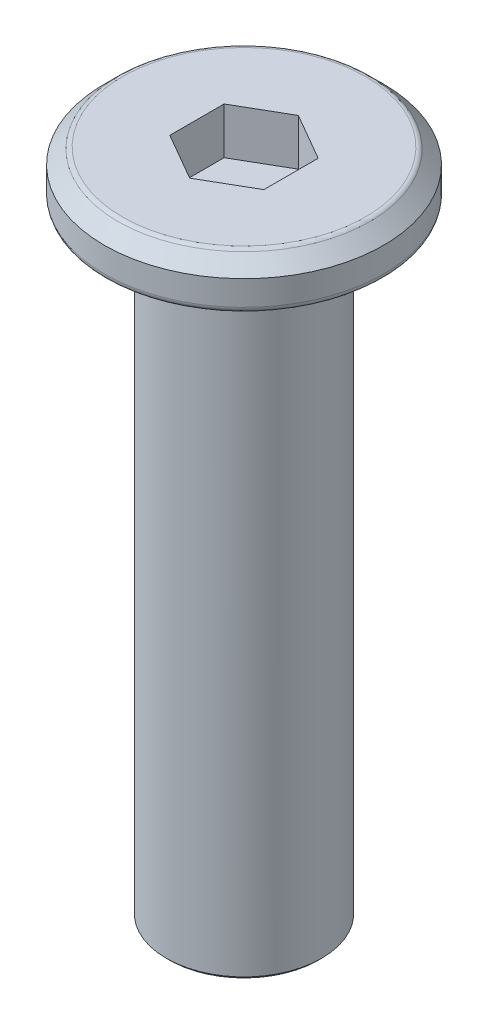
ISO-10303-21;
HEADER;
FILE_DESCRIPTION(('STEP AP214'),'2;1');
FILE_NAME('part.step','',(''),(''),'','','');
FILE_SCHEMA(('AUTOMOTIVE_DESIGN { 1 0 10303 214 1 1 1 1 }'));
ENDSEC;
DATA;
#1=APPLICATION_CONTEXT('core data for automotive mechanical design processes');
#2=APPLICATION_PROTOCOL_DEFINITION('international standard','automotive_design',2000,#1);
#3=PRODUCT_CONTEXT('',#1,'mechanical');
#4=PRODUCT('Part','Part','',(#3));
#5=PRODUCT_RELATED_PRODUCT_CATEGORY('part','',(#4));
#6=PRODUCT_DEFINITION_FORMATION('','',#4);
#7=PRODUCT_DEFINITION_CONTEXT('part definition',#1,'design');
#8=PRODUCT_DEFINITION('design','',#6,#7);
#9=PRODUCT_DEFINITION_SHAPE('','',#8);
#10=(LENGTH_UNIT() NAMED_UNIT(*) SI_UNIT(.MILLI.,.METRE.));
#11=(NAMED_UNIT(*) PLANE_ANGLE_UNIT() SI_UNIT($,.RADIAN.));
#12=(NAMED_UNIT(*) SI_UNIT($,.STERADIAN.) SOLID_ANGLE_UNIT());
#13=UNCERTAINTY_MEASURE_WITH_UNIT(LENGTH_MEASURE(1.E-05),#10,'distance_accuracy_value','');
#14=(GEOMETRIC_REPRESENTATION_CONTEXT(3) GLOBAL_UNCERTAINTY_ASSIGNED_CONTEXT((#13)) GLOBAL_UNIT_ASSIGNED_CONTEXT((#10,
#11,#12)) REPRESENTATION_CONTEXT('',''));
#15=CARTESIAN_POINT('',(0.,0.,0.));
#16=DIRECTION('',(0.,0.,1.));
#17=DIRECTION('',(1.,0.,0.));
#18=AXIS2_PLACEMENT_3D('',#15,#16,#17);
#19=CARTESIAN_POINT('',(0.,1.5,0.));
#20=DIRECTION('',(0.,-1.,0.));
#21=DIRECTION('',(0.,0.,-1.));
#22=AXIS2_PLACEMENT_3D('',#19,#20,#21);
#23=CYLINDRICAL_SURFACE('',#22,4.5);
#24=CARTESIAN_POINT('',(0.,0.2,0.));
#25=DIRECTION('',(0.,1.,0.));
#26=DIRECTION('',(0.,0.,1.));
#27=AXIS2_PLACEMENT_3D('',#24,#25,#26);
#28=CIRCLE('',#27,4.5);
#29=CARTESIAN_POINT('',(0.,0.2,4.5));
#30=VERTEX_POINT('',#29);
#31=EDGE_CURVE('E131',#30,#30,#28,.T.);
#32=ORIENTED_EDGE('',*,*,#31,.T.);
#33=EDGE_LOOP('',(#32));
#34=FACE_BOUND('',#33,.T.);
#35=CARTESIAN_POINT('',(0.,0.999999999999997,0.));
#36=DIRECTION('',(0.,1.,0.));
#37=DIRECTION('',(0.,0.,1.));
#38=AXIS2_PLACEMENT_3D('',#35,#36,#37);
#39=CIRCLE('',#38,4.5);
#40=CARTESIAN_POINT('',(0.,0.999999999999997,4.5));
#41=VERTEX_POINT('',#40);
#42=EDGE_CURVE('E117',#41,#41,#39,.F.);
#43=ORIENTED_EDGE('',*,*,#42,.T.);
#44=EDGE_LOOP('',(#43));
#45=FACE_BOUND('',#44,.T.);
#46=ADVANCED_FACE('F16',(#34,#45),#23,.T.);
#47=CARTESIAN_POINT('',(0.,1.5,0.));
#48=DIRECTION('',(0.,1.,0.));
#49=DIRECTION('',(0.,0.,1.));
#50=AXIS2_PLACEMENT_3D('',#47,#48,#49);
#51=PLANE('',#50);
#52=CARTESIAN_POINT('',(0.,1.5,0.));
#53=DIRECTION('',(0.,1.,0.));
#54=DIRECTION('',(0.,0.,1.));
#55=AXIS2_PLACEMENT_3D('',#52,#53,#54);
#56=CIRCLE('',#55,3.91715728752538);
#57=CARTESIAN_POINT('',(0.,1.5,3.91715728752538));
#58=VERTEX_POINT('',#57);
#59=EDGE_CURVE('E125',#58,#58,#56,.T.);
#60=ORIENTED_EDGE('',*,*,#59,.T.);
#61=EDGE_LOOP('',(#60));
#62=FACE_BOUND('',#61,.T.);
#63=DIRECTION('',(-0.866025403784438,0.,-0.5));
#64=VECTOR('',#63,1.);
#65=CARTESIAN_POINT('',(1.51554445662277,1.5,-0.875));
#66=LINE('',#65,#64);
#67=CARTESIAN_POINT('',(1.51554445662277,1.5,-0.875));
#68=VERTEX_POINT('',#67);
#69=CARTESIAN_POINT('',(0.,1.5,-1.75));
#70=VERTEX_POINT('',#69);
#71=EDGE_CURVE('E32',#68,#70,#66,.T.);
#72=ORIENTED_EDGE('',*,*,#71,.F.);
#73=DIRECTION('',(0.,0.,-1.));
#74=VECTOR('',#73,1.);
#75=CARTESIAN_POINT('',(1.51554445662277,1.5,0.875000000000001));
#76=LINE('',#75,#74);
#77=CARTESIAN_POINT('',(1.51554445662277,1.5,0.875000000000001));
#78=VERTEX_POINT('',#77);
#79=EDGE_CURVE('E113',#78,#68,#76,.T.);
#80=ORIENTED_EDGE('',*,*,#79,.F.);
#81=DIRECTION('',(0.866025403784439,0.,-0.5));
#82=VECTOR('',#81,1.);
#83=CARTESIAN_POINT('',(0.,1.5,1.75));
#84=LINE('',#83,#82);
#85=CARTESIAN_POINT('',(0.,1.5,1.75));
#86=VERTEX_POINT('',#85);
#87=EDGE_CURVE('E111',#86,#78,#84,.T.);
#88=ORIENTED_EDGE('',*,*,#87,.F.);
#89=DIRECTION('',(0.866025403784438,0.,0.5));
#90=VECTOR('',#89,1.);
#91=CARTESIAN_POINT('',(-1.51554445662277,1.5,0.874999999999999));
#92=LINE('',#91,#90);
#93=CARTESIAN_POINT('',(-1.51554445662277,1.5,0.874999999999999));
#94=VERTEX_POINT('',#93);
#95=EDGE_CURVE('E79',#94,#86,#92,.T.);
#96=ORIENTED_EDGE('',*,*,#95,.F.);
#97=DIRECTION('',(0.,0.,1.));
#98=VECTOR('',#97,1.);
#99=CARTESIAN_POINT('',(-1.51554445662277,1.5,-0.875));
#100=LINE('',#99,#98);
#101=CARTESIAN_POINT('',(-1.51554445662277,1.5,-0.875));
#102=VERTEX_POINT('',#101);
#103=EDGE_CURVE('E107',#102,#94,#100,.T.);
#104=ORIENTED_EDGE('',*,*,#103,.F.);
#105=DIRECTION('',(-0.866025403784439,0.,0.5));
#106=VECTOR('',#105,1.);
#107=CARTESIAN_POINT('',(0.,1.5,-1.75));
#108=LINE('',#107,#106);
#109=EDGE_CURVE('E104',#70,#102,#108,.T.);
#110=ORIENTED_EDGE('',*,*,#109,.F.);
#111=EDGE_LOOP('',(#72,#80,#88,#96,#104,#110));
#112=FACE_BOUND('',#111,.T.);
#113=ADVANCED_FACE('F158',(#62,#112),#51,.T.);
#114=CARTESIAN_POINT('',(0.,0.,0.));
#115=DIRECTION('',(0.,1.,0.));
#116=DIRECTION('',(0.,0.,1.));
#117=AXIS2_PLACEMENT_3D('',#114,#115,#116);
#118=PLANE('',#117);
#119=CARTESIAN_POINT('',(0.,0.,0.));
#120=DIRECTION('',(0.,1.,0.));
#121=DIRECTION('',(0.,0.,1.));
#122=AXIS2_PLACEMENT_3D('',#119,#120,#121);
#123=CIRCLE('',#122,2.75);
#124=CARTESIAN_POINT('',(0.,0.,2.75));
#125=VERTEX_POINT('',#124);
#126=EDGE_CURVE('E140',#125,#125,#123,.T.);
#127=ORIENTED_EDGE('',*,*,#126,.T.);
#128=EDGE_LOOP('',(#127));
#129=FACE_BOUND('',#128,.T.);
#130=CARTESIAN_POINT('',(0.,0.,0.));
#131=DIRECTION('',(0.,1.,0.));
#132=DIRECTION('',(0.,0.,1.));
#133=AXIS2_PLACEMENT_3D('',#130,#131,#132);
#134=CIRCLE('',#133,4.3);
#135=CARTESIAN_POINT('',(0.,0.,4.3));
#136=VERTEX_POINT('',#135);
#137=EDGE_CURVE('E134',#136,#136,#134,.F.);
#138=ORIENTED_EDGE('',*,*,#137,.T.);
#139=EDGE_LOOP('',(#138));
#140=FACE_BOUND('',#139,.T.);
#141=ADVANCED_FACE('F164',(#129,#140),#118,.F.);
#142=CARTESIAN_POINT('',(0.,1.5,0.));
#143=DIRECTION('',(0.,-1.,0.));
#144=DIRECTION('',(0.,0.,-1.));
#145=AXIS2_PLACEMENT_3D('',#142,#143,#144);
#146=CONICAL_SURFACE('',#145,4.,0.785398163397447);
#147=CARTESIAN_POINT('',(0.,1.44142135623731,0.));
#148=DIRECTION('',(0.,1.,0.));
#149=DIRECTION('',(0.,0.,1.));
#150=AXIS2_PLACEMENT_3D('',#147,#148,#149);
#151=CIRCLE('',#150,4.05857864376269);
#152=CARTESIAN_POINT('',(0.,1.44142135623731,4.05857864376269));
#153=VERTEX_POINT('',#152);
#154=EDGE_CURVE('E128',#153,#153,#151,.F.);
#155=ORIENTED_EDGE('',*,*,#154,.T.);
#156=EDGE_LOOP('',(#155));
#157=FACE_BOUND('',#156,.T.);
#158=ORIENTED_EDGE('',*,*,#42,.F.);
#159=EDGE_LOOP('',(#158));
#160=FACE_BOUND('',#159,.T.);
#161=ADVANCED_FACE('F170',(#157,#160),#146,.T.);
#162=CARTESIAN_POINT('',(1.51554445662277,0.,-0.875));
#163=DIRECTION('',(0.5,0.,-0.866025403784439));
#164=DIRECTION('',(-0.866025403784439,0.,-0.5));
#165=AXIS2_PLACEMENT_3D('',#162,#163,#164);
#166=PLANE('',#165);
#167=ORIENTED_EDGE('',*,*,#71,.T.);
#168=DIRECTION('',(0.,1.,0.));
#169=VECTOR('',#168,1.);
#170=CARTESIAN_POINT('',(0.,0.,-1.75));
#171=LINE('',#170,#169);
#172=CARTESIAN_POINT('',(0.,0.,-1.75));
#173=VERTEX_POINT('',#172);
#174=EDGE_CURVE('E63',#173,#70,#171,.T.);
#175=ORIENTED_EDGE('',*,*,#174,.F.);
#176=DIRECTION('',(-0.866025403784438,0.,-0.5));
#177=VECTOR('',#176,1.);
#178=CARTESIAN_POINT('',(1.51554445662277,0.,-0.875));
#179=LINE('',#178,#177);
#180=CARTESIAN_POINT('',(1.51554445662277,0.,-0.875));
#181=VERTEX_POINT('',#180);
#182=EDGE_CURVE('E115',#181,#173,#179,.T.);
#183=ORIENTED_EDGE('',*,*,#182,.F.);
#184=DIRECTION('',(0.,1.,0.));
#185=VECTOR('',#184,1.);
#186=CARTESIAN_POINT('',(1.51554445662277,0.,-0.875));
#187=LINE('',#186,#185);
#188=EDGE_CURVE('E40',#181,#68,#187,.T.);
#189=ORIENTED_EDGE('',*,*,#188,.T.);
#190=EDGE_LOOP('',(#167,#175,#183,#189));
#191=FACE_BOUND('',#190,.T.);
#192=ADVANCED_FACE('F173',(#191),#166,.F.);
#193=CARTESIAN_POINT('',(1.51554445662277,0.,0.875000000000001));
#194=DIRECTION('',(1.,0.,0.));
#195=DIRECTION('',(0.,0.,-1.));
#196=AXIS2_PLACEMENT_3D('',#193,#194,#195);
#197=PLANE('',#196);
#198=ORIENTED_EDGE('',*,*,#79,.T.);
#199=ORIENTED_EDGE('',*,*,#188,.F.);
#200=DIRECTION('',(0.,0.,-1.));
#201=VECTOR('',#200,1.);
#202=CARTESIAN_POINT('',(1.51554445662277,0.,0.875000000000001));
#203=LINE('',#202,#201);
#204=CARTESIAN_POINT('',(1.51554445662277,0.,0.875000000000001));
#205=VERTEX_POINT('',#204);
#206=EDGE_CURVE('E91',#205,#181,#203,.T.);
#207=ORIENTED_EDGE('',*,*,#206,.F.);
#208=DIRECTION('',(0.,1.,0.));
#209=VECTOR('',#208,1.);
#210=CARTESIAN_POINT('',(1.51554445662277,0.,0.875000000000001));
#211=LINE('',#210,#209);
#212=EDGE_CURVE('E83',#205,#78,#211,.T.);
#213=ORIENTED_EDGE('',*,*,#212,.T.);
#214=EDGE_LOOP('',(#198,#199,#207,#213));
#215=FACE_BOUND('',#214,.T.);
#216=ADVANCED_FACE('F207',(#215),#197,.F.);
#217=CARTESIAN_POINT('',(0.,0.,1.75));
#218=DIRECTION('',(0.5,0.,0.866025403784439));
#219=DIRECTION('',(0.866025403784439,0.,-0.5));
#220=AXIS2_PLACEMENT_3D('',#217,#218,#219);
#221=PLANE('',#220);
#222=ORIENTED_EDGE('',*,*,#87,.T.);
#223=ORIENTED_EDGE('',*,*,#212,.F.);
#224=DIRECTION('',(0.866025403784439,0.,-0.5));
#225=VECTOR('',#224,1.);
#226=CARTESIAN_POINT('',(0.,0.,1.75));
#227=LINE('',#226,#225);
#228=CARTESIAN_POINT('',(0.,0.,1.75));
#229=VERTEX_POINT('',#228);
#230=EDGE_CURVE('E87',#229,#205,#227,.T.);
#231=ORIENTED_EDGE('',*,*,#230,.F.);
#232=DIRECTION('',(0.,1.,0.));
#233=VECTOR('',#232,1.);
#234=CARTESIAN_POINT('',(0.,0.,1.75));
#235=LINE('',#234,#233);
#236=EDGE_CURVE('E72',#229,#86,#235,.T.);
#237=ORIENTED_EDGE('',*,*,#236,.T.);
#238=EDGE_LOOP('',(#222,#223,#231,#237));
#239=FACE_BOUND('',#238,.T.);
#240=ADVANCED_FACE('F88',(#239),#221,.F.);
#241=CARTESIAN_POINT('',(-1.51554445662277,0.,0.874999999999999));
#242=DIRECTION('',(-0.5,0.,0.866025403784438));
#243=DIRECTION('',(0.866025403784439,0.,0.5));
#244=AXIS2_PLACEMENT_3D('',#241,#242,#243);
#245=PLANE('',#244);
#246=ORIENTED_EDGE('',*,*,#95,.T.);
#247=ORIENTED_EDGE('',*,*,#236,.F.);
#248=DIRECTION('',(0.866025403784438,0.,0.5));
#249=VECTOR('',#248,1.);
#250=CARTESIAN_POINT('',(-1.51554445662277,0.,0.874999999999999));
#251=LINE('',#250,#249);
#252=CARTESIAN_POINT('',(-1.51554445662277,0.,0.874999999999999));
#253=VERTEX_POINT('',#252);
#254=EDGE_CURVE('E76',#253,#229,#251,.T.);
#255=ORIENTED_EDGE('',*,*,#254,.F.);
#256=DIRECTION('',(0.,1.,0.));
#257=VECTOR('',#256,1.);
#258=CARTESIAN_POINT('',(-1.51554445662277,0.,0.874999999999999));
#259=LINE('',#258,#257);
#260=EDGE_CURVE('E84',#253,#94,#259,.T.);
#261=ORIENTED_EDGE('',*,*,#260,.T.);
#262=EDGE_LOOP('',(#246,#247,#255,#261));
#263=FACE_BOUND('',#262,.T.);
#264=ADVANCED_FACE('F74',(#263),#245,.F.);
#265=CARTESIAN_POINT('',(-1.51554445662277,0.,-0.875));
#266=DIRECTION('',(-1.,0.,0.));
#267=DIRECTION('',(0.,0.,1.));
#268=AXIS2_PLACEMENT_3D('',#265,#266,#267);
#269=PLANE('',#268);
#270=ORIENTED_EDGE('',*,*,#103,.T.);
#271=ORIENTED_EDGE('',*,*,#260,.F.);
#272=DIRECTION('',(0.,0.,1.));
#273=VECTOR('',#272,1.);
#274=CARTESIAN_POINT('',(-1.51554445662277,0.,-0.875));
#275=LINE('',#274,#273);
#276=CARTESIAN_POINT('',(-1.51554445662277,0.,-0.875000000000001));
#277=VERTEX_POINT('',#276);
#278=EDGE_CURVE('E96',#277,#253,#275,.T.);
#279=ORIENTED_EDGE('',*,*,#278,.F.);
#280=DIRECTION('',(0.,1.,0.));
#281=VECTOR('',#280,1.);
#282=CARTESIAN_POINT('',(-1.51554445662277,0.,-0.875));
#283=LINE('',#282,#281);
#284=EDGE_CURVE('E120',#277,#102,#283,.T.);
#285=ORIENTED_EDGE('',*,*,#284,.T.);
#286=EDGE_LOOP('',(#270,#271,#279,#285));
#287=FACE_BOUND('',#286,.T.);
#288=ADVANCED_FACE('F214',(#287),#269,.F.);
#289=CARTESIAN_POINT('',(0.,0.,-1.75));
#290=DIRECTION('',(-0.5,0.,-0.866025403784439));
#291=DIRECTION('',(-0.866025403784439,0.,0.5));
#292=AXIS2_PLACEMENT_3D('',#289,#290,#291);
#293=PLANE('',#292);
#294=ORIENTED_EDGE('',*,*,#109,.T.);
#295=ORIENTED_EDGE('',*,*,#284,.F.);
#296=DIRECTION('',(-0.866025403784439,0.,0.5));
#297=VECTOR('',#296,1.);
#298=CARTESIAN_POINT('',(0.,0.,-1.75));
#299=LINE('',#298,#297);
#300=EDGE_CURVE('E98',#173,#277,#299,.T.);
#301=ORIENTED_EDGE('',*,*,#300,.F.);
#302=ORIENTED_EDGE('',*,*,#174,.T.);
#303=EDGE_LOOP('',(#294,#295,#301,#302));
#304=FACE_BOUND('',#303,.T.);
#305=ADVANCED_FACE('F204',(#304),#293,.F.);
#306=CARTESIAN_POINT('',(0.,0.,0.));
#307=DIRECTION('',(0.,-1.,0.));
#308=DIRECTION('',(0.,0.,-1.));
#309=AXIS2_PLACEMENT_3D('',#306,#307,#308);
#310=PLANE('',#309);
#311=ORIENTED_EDGE('',*,*,#206,.T.);
#312=ORIENTED_EDGE('',*,*,#182,.T.);
#313=ORIENTED_EDGE('',*,*,#300,.T.);
#314=ORIENTED_EDGE('',*,*,#278,.T.);
#315=ORIENTED_EDGE('',*,*,#254,.T.);
#316=ORIENTED_EDGE('',*,*,#230,.T.);
#317=EDGE_LOOP('',(#311,#312,#313,#314,#315,#316));
#318=FACE_BOUND('',#317,.T.);
#319=ADVANCED_FACE('F93',(#318),#310,.F.);
#320=CARTESIAN_POINT('',(0.,-20.,0.));
#321=DIRECTION('',(0.,1.,0.));
#322=DIRECTION('',(0.,0.,1.));
#323=AXIS2_PLACEMENT_3D('',#320,#321,#322);
#324=CYLINDRICAL_SURFACE('',#323,2.5);
#325=CARTESIAN_POINT('',(0.,-19.9,0.));
#326=DIRECTION('',(0.,-1.,0.));
#327=DIRECTION('',(0.,0.,-1.));
#328=AXIS2_PLACEMENT_3D('',#325,#326,#327);
#329=CIRCLE('',#328,2.5);
#330=CARTESIAN_POINT('',(0.,-19.9,-2.5));
#331=VERTEX_POINT('',#330);
#332=EDGE_CURVE('E10',#331,#331,#329,.F.);
#333=ORIENTED_EDGE('',*,*,#332,.T.);
#334=EDGE_LOOP('',(#333));
#335=FACE_BOUND('',#334,.T.);
#336=CARTESIAN_POINT('',(0.,-0.25,0.));
#337=DIRECTION('',(0.,1.,0.));
#338=DIRECTION('',(0.,0.,1.));
#339=AXIS2_PLACEMENT_3D('',#336,#337,#338);
#340=CIRCLE('',#339,2.5);
#341=CARTESIAN_POINT('',(0.,-0.25,2.5));
#342=VERTEX_POINT('',#341);
#343=EDGE_CURVE('E137',#342,#342,#340,.F.);
#344=ORIENTED_EDGE('',*,*,#343,.T.);
#345=EDGE_LOOP('',(#344));
#346=FACE_BOUND('',#345,.T.);
#347=ADVANCED_FACE('F195',(#335,#346),#324,.T.);
#348=CARTESIAN_POINT('',(0.,-20.,0.));
#349=DIRECTION('',(0.,-1.,0.));
#350=DIRECTION('',(0.,0.,-1.));
#351=AXIS2_PLACEMENT_3D('',#348,#349,#350);
#352=PLANE('',#351);
#353=CARTESIAN_POINT('',(0.,-20.,0.));
#354=DIRECTION('',(0.,-1.,0.));
#355=DIRECTION('',(0.,0.,-1.));
#356=AXIS2_PLACEMENT_3D('',#353,#354,#355);
#357=CIRCLE('',#356,2.4);
#358=CARTESIAN_POINT('',(0.,-20.,-2.4));
#359=VERTEX_POINT('',#358);
#360=EDGE_CURVE('E25',#359,#359,#357,.T.);
#361=ORIENTED_EDGE('',*,*,#360,.T.);
#362=EDGE_LOOP('',(#361));
#363=FACE_BOUND('',#362,.T.);
#364=ADVANCED_FACE('F145',(#363),#352,.T.);
#365=CARTESIAN_POINT('',(0.,1.3,0.));
#366=DIRECTION('',(0.,1.,0.));
#367=DIRECTION('',(0.,0.,1.));
#368=AXIS2_PLACEMENT_3D('',#365,#366,#367);
#369=TOROIDAL_SURFACE('',#368,3.91715728752538,0.2);
#370=ORIENTED_EDGE('',*,*,#154,.F.);
#371=EDGE_LOOP('',(#370));
#372=FACE_BOUND('',#371,.T.);
#373=ORIENTED_EDGE('',*,*,#59,.F.);
#374=EDGE_LOOP('',(#373));
#375=FACE_BOUND('',#374,.T.);
#376=ADVANCED_FACE('F175',(#372,#375),#369,.T.);
#377=CARTESIAN_POINT('',(0.,0.2,0.));
#378=DIRECTION('',(0.,1.,0.));
#379=DIRECTION('',(0.,0.,1.));
#380=AXIS2_PLACEMENT_3D('',#377,#378,#379);
#381=TOROIDAL_SURFACE('',#380,4.3,0.2);
#382=ORIENTED_EDGE('',*,*,#137,.F.);
#383=EDGE_LOOP('',(#382));
#384=FACE_BOUND('',#383,.T.);
#385=ORIENTED_EDGE('',*,*,#31,.F.);
#386=EDGE_LOOP('',(#385));
#387=FACE_BOUND('',#386,.T.);
#388=ADVANCED_FACE('F154',(#384,#387),#381,.T.);
#389=CARTESIAN_POINT('',(0.,-0.25,0.));
#390=DIRECTION('',(0.,1.,0.));
#391=DIRECTION('',(0.,0.,1.));
#392=AXIS2_PLACEMENT_3D('',#389,#390,#391);
#393=TOROIDAL_SURFACE('',#392,2.75,0.25);
#394=ORIENTED_EDGE('',*,*,#126,.F.);
#395=EDGE_LOOP('',(#394));
#396=FACE_BOUND('',#395,.T.);
#397=ORIENTED_EDGE('',*,*,#343,.F.);
#398=EDGE_LOOP('',(#397));
#399=FACE_BOUND('',#398,.T.);
#400=ADVANCED_FACE('F148',(#396,#399),#393,.F.);
#401=CARTESIAN_POINT('',(0.,-20.,0.));
#402=DIRECTION('',(0.,1.,0.));
#403=DIRECTION('',(0.,0.,1.));
#404=AXIS2_PLACEMENT_3D('',#401,#402,#403);
#405=CONICAL_SURFACE('',#404,2.4,0.785398163397455);
#406=ORIENTED_EDGE('',*,*,#332,.F.);
#407=EDGE_LOOP('',(#406));
#408=FACE_BOUND('',#407,.T.);
#409=ORIENTED_EDGE('',*,*,#360,.F.);
#410=EDGE_LOOP('',(#409));
#411=FACE_BOUND('',#410,.T.);
#412=ADVANCED_FACE('F19',(#408,#411),#405,.T.);
#413=CLOSED_SHELL('',(#46,#113,#141,#161,#192,#216,#240,#264,#288,#305,#319,#347,#364,#376,#388,
#400,#412));
#414=MANIFOLD_SOLID_BREP('B1',#413);
#415=ADVANCED_BREP_SHAPE_REPRESENTATION('',(#18,#414),#14);
#416=SHAPE_DEFINITION_REPRESENTATION(#9,#415);
ENDSEC;
END-ISO-10303-21;
